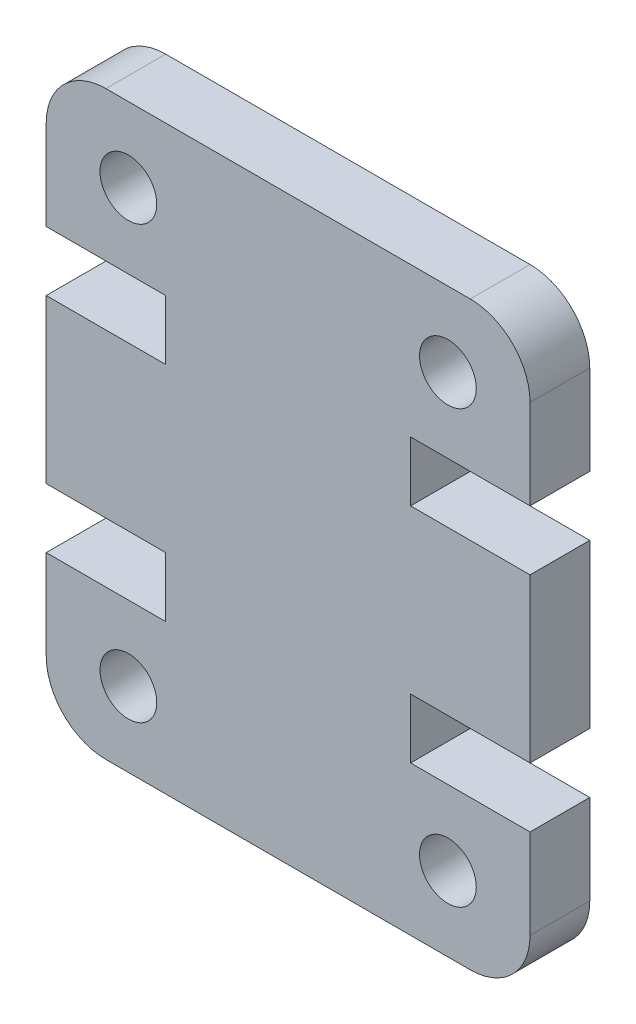
ISO-10303-21;
HEADER;
FILE_DESCRIPTION(('STEP AP214'),'2;1');
FILE_NAME('part.step','',(''),(''),'','','');
FILE_SCHEMA(('AUTOMOTIVE_DESIGN { 1 0 10303 214 1 1 1 1 }'));
ENDSEC;
DATA;
#1=APPLICATION_CONTEXT('core data for automotive mechanical design processes');
#2=APPLICATION_PROTOCOL_DEFINITION('international standard','automotive_design',2000,#1);
#3=PRODUCT_CONTEXT('',#1,'mechanical');
#4=PRODUCT('Part','Part','',(#3));
#5=PRODUCT_RELATED_PRODUCT_CATEGORY('part','',(#4));
#6=PRODUCT_DEFINITION_FORMATION('','',#4);
#7=PRODUCT_DEFINITION_CONTEXT('part definition',#1,'design');
#8=PRODUCT_DEFINITION('design','',#6,#7);
#9=PRODUCT_DEFINITION_SHAPE('','',#8);
#10=(LENGTH_UNIT() NAMED_UNIT(*) SI_UNIT(.MILLI.,.METRE.));
#11=(NAMED_UNIT(*) PLANE_ANGLE_UNIT() SI_UNIT($,.RADIAN.));
#12=(NAMED_UNIT(*) SI_UNIT($,.STERADIAN.) SOLID_ANGLE_UNIT());
#13=UNCERTAINTY_MEASURE_WITH_UNIT(LENGTH_MEASURE(1.E-05),#10,'distance_accuracy_value','');
#14=(GEOMETRIC_REPRESENTATION_CONTEXT(3) GLOBAL_UNCERTAINTY_ASSIGNED_CONTEXT((#13)) GLOBAL_UNIT_ASSIGNED_CONTEXT((#10,
#11,#12)) REPRESENTATION_CONTEXT('',''));
#15=CARTESIAN_POINT('',(0.,0.,0.));
#16=DIRECTION('',(0.,0.,1.));
#17=DIRECTION('',(1.,0.,0.));
#18=AXIS2_PLACEMENT_3D('',#15,#16,#17);
#19=CARTESIAN_POINT('',(14.1999999999999,2.00000000000013,4.));
#20=DIRECTION('',(0.,0.,-1.));
#21=DIRECTION('',(-1.,0.,0.));
#22=AXIS2_PLACEMENT_3D('',#19,#20,#21);
#23=CYLINDRICAL_SURFACE('',#22,2.00000000000013);
#24=CARTESIAN_POINT('',(14.1999999999999,2.00000000000013,2.));
#25=DIRECTION('',(0.,0.,1.));
#26=DIRECTION('',(1.,0.,0.));
#27=AXIS2_PLACEMENT_3D('',#24,#25,#26);
#28=CIRCLE('',#27,2.00000000000013);
#29=CARTESIAN_POINT('',(14.1999999999999,0.,2.));
#30=VERTEX_POINT('',#29);
#31=CARTESIAN_POINT('',(16.2,2.00000000000013,2.));
#32=VERTEX_POINT('',#31);
#33=EDGE_CURVE('E387',#30,#32,#28,.T.);
#34=ORIENTED_EDGE('',*,*,#33,.F.);
#35=DIRECTION('',(0.,0.,-1.));
#36=VECTOR('',#35,1.);
#37=CARTESIAN_POINT('',(14.1999999999999,0.,4.));
#38=LINE('',#37,#36);
#39=CARTESIAN_POINT('',(14.1999999999999,0.,0.));
#40=VERTEX_POINT('',#39);
#41=EDGE_CURVE('E56',#30,#40,#38,.T.);
#42=ORIENTED_EDGE('',*,*,#41,.T.);
#43=CARTESIAN_POINT('',(14.1999999999999,2.00000000000013,0.));
#44=DIRECTION('',(0.,0.,1.));
#45=DIRECTION('',(-1.,0.,0.));
#46=AXIS2_PLACEMENT_3D('',#43,#44,#45);
#47=CIRCLE('',#46,2.00000000000013);
#48=CARTESIAN_POINT('',(16.2,2.00000000000013,0.));
#49=VERTEX_POINT('',#48);
#50=EDGE_CURVE('E265',#40,#49,#47,.T.);
#51=ORIENTED_EDGE('',*,*,#50,.T.);
#52=DIRECTION('',(0.,0.,-1.));
#53=VECTOR('',#52,1.);
#54=CARTESIAN_POINT('',(16.2,2.00000000000013,4.));
#55=LINE('',#54,#53);
#56=EDGE_CURVE('E11',#32,#49,#55,.T.);
#57=ORIENTED_EDGE('',*,*,#56,.F.);
#58=EDGE_LOOP('',(#34,#42,#51,#57));
#59=FACE_BOUND('',#58,.T.);
#60=ADVANCED_FACE('F33',(#59),#23,.T.);
#61=CARTESIAN_POINT('',(16.2,5.00000000000021,4.));
#62=DIRECTION('',(-1.,0.,0.));
#63=DIRECTION('',(0.,0.,1.));
#64=AXIS2_PLACEMENT_3D('',#61,#62,#63);
#65=PLANE('',#64);
#66=DIRECTION('',(0.,1.,0.));
#67=VECTOR('',#66,1.);
#68=CARTESIAN_POINT('',(16.2,0.,2.));
#69=LINE('',#68,#67);
#70=CARTESIAN_POINT('',(16.2,5.00000000000021,2.));
#71=VERTEX_POINT('',#70);
#72=EDGE_CURVE('E435',#32,#71,#69,.T.);
#73=ORIENTED_EDGE('',*,*,#72,.F.);
#74=ORIENTED_EDGE('',*,*,#56,.T.);
#75=DIRECTION('',(0.,1.,0.));
#76=VECTOR('',#75,1.);
#77=CARTESIAN_POINT('',(16.2,5.00000000000021,0.));
#78=LINE('',#77,#76);
#79=CARTESIAN_POINT('',(16.2,5.00000000000021,0.));
#80=VERTEX_POINT('',#79);
#81=EDGE_CURVE('E260',#49,#80,#78,.T.);
#82=ORIENTED_EDGE('',*,*,#81,.T.);
#83=DIRECTION('',(0.,0.,-1.));
#84=VECTOR('',#83,1.);
#85=CARTESIAN_POINT('',(16.2,5.00000000000021,4.));
#86=LINE('',#85,#84);
#87=EDGE_CURVE('E41',#71,#80,#86,.T.);
#88=ORIENTED_EDGE('',*,*,#87,.F.);
#89=EDGE_LOOP('',(#73,#74,#82,#88));
#90=FACE_BOUND('',#89,.T.);
#91=ADVANCED_FACE('F261',(#90),#65,.F.);
#92=CARTESIAN_POINT('',(12.1999999999997,5.00000000000021,4.));
#93=DIRECTION('',(0.,-1.,0.));
#94=DIRECTION('',(0.,0.,-1.));
#95=AXIS2_PLACEMENT_3D('',#92,#93,#94);
#96=PLANE('',#95);
#97=DIRECTION('',(-1.,0.,0.));
#98=VECTOR('',#97,1.);
#99=CARTESIAN_POINT('',(12.1999999999997,5.00000000000021,2.));
#100=LINE('',#99,#98);
#101=CARTESIAN_POINT('',(12.1999999999997,5.00000000000021,2.));
#102=VERTEX_POINT('',#101);
#103=EDGE_CURVE('E256',#71,#102,#100,.T.);
#104=ORIENTED_EDGE('',*,*,#103,.F.);
#105=ORIENTED_EDGE('',*,*,#87,.T.);
#106=DIRECTION('',(-1.,0.,0.));
#107=VECTOR('',#106,1.);
#108=CARTESIAN_POINT('',(12.1999999999997,5.00000000000021,0.));
#109=LINE('',#108,#107);
#110=CARTESIAN_POINT('',(12.1999999999997,5.00000000000021,0.));
#111=VERTEX_POINT('',#110);
#112=EDGE_CURVE('E254',#80,#111,#109,.T.);
#113=ORIENTED_EDGE('',*,*,#112,.T.);
#114=DIRECTION('',(0.,0.,-1.));
#115=VECTOR('',#114,1.);
#116=CARTESIAN_POINT('',(12.1999999999997,5.00000000000021,4.));
#117=LINE('',#116,#115);
#118=EDGE_CURVE('E244',#102,#111,#117,.T.);
#119=ORIENTED_EDGE('',*,*,#118,.F.);
#120=EDGE_LOOP('',(#104,#105,#113,#119));
#121=FACE_BOUND('',#120,.T.);
#122=ADVANCED_FACE('F251',(#121),#96,.F.);
#123=CARTESIAN_POINT('',(12.1999999999997,7.00000000000034,4.));
#124=DIRECTION('',(-1.,0.,0.));
#125=DIRECTION('',(0.,0.,1.));
#126=AXIS2_PLACEMENT_3D('',#123,#124,#125);
#127=PLANE('',#126);
#128=DIRECTION('',(0.,1.,0.));
#129=VECTOR('',#128,1.);
#130=CARTESIAN_POINT('',(12.1999999999997,7.00000000000034,2.));
#131=LINE('',#130,#129);
#132=CARTESIAN_POINT('',(12.1999999999997,7.00000000000034,2.));
#133=VERTEX_POINT('',#132);
#134=EDGE_CURVE('E384',#102,#133,#131,.T.);
#135=ORIENTED_EDGE('',*,*,#134,.F.);
#136=ORIENTED_EDGE('',*,*,#118,.T.);
#137=DIRECTION('',(0.,1.,0.));
#138=VECTOR('',#137,1.);
#139=CARTESIAN_POINT('',(12.1999999999997,7.00000000000034,0.));
#140=LINE('',#139,#138);
#141=CARTESIAN_POINT('',(12.1999999999997,7.00000000000034,0.));
#142=VERTEX_POINT('',#141);
#143=EDGE_CURVE('E271',#111,#142,#140,.T.);
#144=ORIENTED_EDGE('',*,*,#143,.T.);
#145=DIRECTION('',(0.,0.,-1.));
#146=VECTOR('',#145,1.);
#147=CARTESIAN_POINT('',(12.1999999999997,7.00000000000034,4.));
#148=LINE('',#147,#146);
#149=EDGE_CURVE('E242',#133,#142,#148,.T.);
#150=ORIENTED_EDGE('',*,*,#149,.F.);
#151=EDGE_LOOP('',(#135,#136,#144,#150));
#152=FACE_BOUND('',#151,.T.);
#153=ADVANCED_FACE('F483',(#152),#127,.F.);
#154=CARTESIAN_POINT('',(16.2,7.00000000000034,4.));
#155=DIRECTION('',(0.,1.,0.));
#156=DIRECTION('',(-1.,0.,0.));
#157=AXIS2_PLACEMENT_3D('',#154,#155,#156);
#158=PLANE('',#157);
#159=DIRECTION('',(1.,0.,0.));
#160=VECTOR('',#159,1.);
#161=CARTESIAN_POINT('',(16.2,7.00000000000034,2.));
#162=LINE('',#161,#160);
#163=CARTESIAN_POINT('',(16.2,7.00000000000034,2.));
#164=VERTEX_POINT('',#163);
#165=EDGE_CURVE('E382',#133,#164,#162,.T.);
#166=ORIENTED_EDGE('',*,*,#165,.F.);
#167=ORIENTED_EDGE('',*,*,#149,.T.);
#168=DIRECTION('',(1.,0.,0.));
#169=VECTOR('',#168,1.);
#170=CARTESIAN_POINT('',(16.2,7.00000000000034,0.));
#171=LINE('',#170,#169);
#172=CARTESIAN_POINT('',(16.2,7.00000000000034,0.));
#173=VERTEX_POINT('',#172);
#174=EDGE_CURVE('E273',#142,#173,#171,.T.);
#175=ORIENTED_EDGE('',*,*,#174,.T.);
#176=DIRECTION('',(0.,0.,-1.));
#177=VECTOR('',#176,1.);
#178=CARTESIAN_POINT('',(16.2,7.00000000000034,4.));
#179=LINE('',#178,#177);
#180=EDGE_CURVE('E240',#164,#173,#179,.T.);
#181=ORIENTED_EDGE('',*,*,#180,.F.);
#182=EDGE_LOOP('',(#166,#167,#175,#181));
#183=FACE_BOUND('',#182,.T.);
#184=ADVANCED_FACE('F488',(#183),#158,.F.);
#185=CARTESIAN_POINT('',(16.2,7.00000000000034,4.));
#186=DIRECTION('',(-1.,0.,0.));
#187=DIRECTION('',(0.,0.,1.));
#188=AXIS2_PLACEMENT_3D('',#185,#186,#187);
#189=PLANE('',#188);
#190=CARTESIAN_POINT('',(16.2,12.4549999999997,2.));
#191=VERTEX_POINT('',#190);
#192=EDGE_CURVE('E434',#164,#191,#69,.T.);
#193=ORIENTED_EDGE('',*,*,#192,.F.);
#194=ORIENTED_EDGE('',*,*,#180,.T.);
#195=DIRECTION('',(0.,1.,0.));
#196=VECTOR('',#195,1.);
#197=CARTESIAN_POINT('',(16.2,7.00000000000034,0.));
#198=LINE('',#197,#196);
#199=CARTESIAN_POINT('',(16.2,12.4549999999997,0.));
#200=VERTEX_POINT('',#199);
#201=EDGE_CURVE('E279',#173,#200,#198,.T.);
#202=ORIENTED_EDGE('',*,*,#201,.T.);
#203=DIRECTION('',(0.,0.,-1.));
#204=VECTOR('',#203,1.);
#205=CARTESIAN_POINT('',(16.2,12.4549999999997,4.));
#206=LINE('',#205,#204);
#207=EDGE_CURVE('E238',#191,#200,#206,.T.);
#208=ORIENTED_EDGE('',*,*,#207,.F.);
#209=EDGE_LOOP('',(#193,#194,#202,#208));
#210=FACE_BOUND('',#209,.T.);
#211=ADVANCED_FACE('F492',(#210),#189,.F.);
#212=CARTESIAN_POINT('',(16.2,12.4549999999997,4.));
#213=DIRECTION('',(0.,-1.,0.));
#214=DIRECTION('',(1.,0.,0.));
#215=AXIS2_PLACEMENT_3D('',#212,#213,#214);
#216=PLANE('',#215);
#217=DIRECTION('',(-1.,0.,0.));
#218=VECTOR('',#217,1.);
#219=CARTESIAN_POINT('',(16.2,12.4549999999997,2.));
#220=LINE('',#219,#218);
#221=CARTESIAN_POINT('',(12.1999999999997,12.4549999999997,2.));
#222=VERTEX_POINT('',#221);
#223=EDGE_CURVE('E380',#191,#222,#220,.T.);
#224=ORIENTED_EDGE('',*,*,#223,.F.);
#225=ORIENTED_EDGE('',*,*,#207,.T.);
#226=DIRECTION('',(-1.,0.,0.));
#227=VECTOR('',#226,1.);
#228=CARTESIAN_POINT('',(16.2,12.4549999999997,0.));
#229=LINE('',#228,#227);
#230=CARTESIAN_POINT('',(12.1999999999997,12.4549999999997,0.));
#231=VERTEX_POINT('',#230);
#232=EDGE_CURVE('E282',#200,#231,#229,.T.);
#233=ORIENTED_EDGE('',*,*,#232,.T.);
#234=DIRECTION('',(0.,0.,-1.));
#235=VECTOR('',#234,1.);
#236=CARTESIAN_POINT('',(12.1999999999997,12.4549999999997,4.));
#237=LINE('',#236,#235);
#238=EDGE_CURVE('E236',#222,#231,#237,.T.);
#239=ORIENTED_EDGE('',*,*,#238,.F.);
#240=EDGE_LOOP('',(#224,#225,#233,#239));
#241=FACE_BOUND('',#240,.T.);
#242=ADVANCED_FACE('F496',(#241),#216,.F.);
#243=CARTESIAN_POINT('',(12.1999999999997,12.4549999999997,4.));
#244=DIRECTION('',(-1.,0.,0.));
#245=DIRECTION('',(0.,0.,1.));
#246=AXIS2_PLACEMENT_3D('',#243,#244,#245);
#247=PLANE('',#246);
#248=DIRECTION('',(0.,1.,0.));
#249=VECTOR('',#248,1.);
#250=CARTESIAN_POINT('',(12.1999999999997,12.4549999999997,2.));
#251=LINE('',#250,#249);
#252=CARTESIAN_POINT('',(12.1999999999997,14.4549999999998,2.));
#253=VERTEX_POINT('',#252);
#254=EDGE_CURVE('E378',#222,#253,#251,.T.);
#255=ORIENTED_EDGE('',*,*,#254,.F.);
#256=ORIENTED_EDGE('',*,*,#238,.T.);
#257=DIRECTION('',(0.,1.,0.));
#258=VECTOR('',#257,1.);
#259=CARTESIAN_POINT('',(12.1999999999997,12.4549999999997,0.));
#260=LINE('',#259,#258);
#261=CARTESIAN_POINT('',(12.1999999999997,14.4549999999998,0.));
#262=VERTEX_POINT('',#261);
#263=EDGE_CURVE('E285',#231,#262,#260,.T.);
#264=ORIENTED_EDGE('',*,*,#263,.T.);
#265=DIRECTION('',(0.,0.,-1.));
#266=VECTOR('',#265,1.);
#267=CARTESIAN_POINT('',(12.1999999999997,14.4549999999998,4.));
#268=LINE('',#267,#266);
#269=EDGE_CURVE('E234',#253,#262,#268,.T.);
#270=ORIENTED_EDGE('',*,*,#269,.F.);
#271=EDGE_LOOP('',(#255,#256,#264,#270));
#272=FACE_BOUND('',#271,.T.);
#273=ADVANCED_FACE('F500',(#272),#247,.F.);
#274=CARTESIAN_POINT('',(12.1999999999997,14.4549999999998,4.));
#275=DIRECTION('',(0.,1.,0.));
#276=DIRECTION('',(0.,0.,1.));
#277=AXIS2_PLACEMENT_3D('',#274,#275,#276);
#278=PLANE('',#277);
#279=DIRECTION('',(1.,0.,0.));
#280=VECTOR('',#279,1.);
#281=CARTESIAN_POINT('',(12.1999999999997,14.4549999999998,2.));
#282=LINE('',#281,#280);
#283=CARTESIAN_POINT('',(16.2,14.4549999999998,2.));
#284=VERTEX_POINT('',#283);
#285=EDGE_CURVE('E376',#253,#284,#282,.T.);
#286=ORIENTED_EDGE('',*,*,#285,.F.);
#287=ORIENTED_EDGE('',*,*,#269,.T.);
#288=DIRECTION('',(1.,0.,0.));
#289=VECTOR('',#288,1.);
#290=CARTESIAN_POINT('',(12.1999999999997,14.4549999999998,0.));
#291=LINE('',#290,#289);
#292=CARTESIAN_POINT('',(16.2,14.4549999999998,0.));
#293=VERTEX_POINT('',#292);
#294=EDGE_CURVE('E288',#262,#293,#291,.T.);
#295=ORIENTED_EDGE('',*,*,#294,.T.);
#296=DIRECTION('',(0.,0.,-1.));
#297=VECTOR('',#296,1.);
#298=CARTESIAN_POINT('',(16.2,14.4549999999998,4.));
#299=LINE('',#298,#297);
#300=EDGE_CURVE('E232',#284,#293,#299,.T.);
#301=ORIENTED_EDGE('',*,*,#300,.F.);
#302=EDGE_LOOP('',(#286,#287,#295,#301));
#303=FACE_BOUND('',#302,.T.);
#304=ADVANCED_FACE('F504',(#303),#278,.F.);
#305=CARTESIAN_POINT('',(16.2,14.4549999999998,4.));
#306=DIRECTION('',(-1.,0.,0.));
#307=DIRECTION('',(0.,0.,1.));
#308=AXIS2_PLACEMENT_3D('',#305,#306,#307);
#309=PLANE('',#308);
#310=CARTESIAN_POINT('',(16.2,17.4549999999999,2.));
#311=VERTEX_POINT('',#310);
#312=EDGE_CURVE('E432',#284,#311,#69,.T.);
#313=ORIENTED_EDGE('',*,*,#312,.F.);
#314=ORIENTED_EDGE('',*,*,#300,.T.);
#315=DIRECTION('',(0.,1.,0.));
#316=VECTOR('',#315,1.);
#317=CARTESIAN_POINT('',(16.2,14.4549999999998,0.));
#318=LINE('',#317,#316);
#319=CARTESIAN_POINT('',(16.2,17.4549999999999,0.));
#320=VERTEX_POINT('',#319);
#321=EDGE_CURVE('E291',#293,#320,#318,.T.);
#322=ORIENTED_EDGE('',*,*,#321,.T.);
#323=DIRECTION('',(0.,0.,-1.));
#324=VECTOR('',#323,1.);
#325=CARTESIAN_POINT('',(16.2,17.4549999999999,4.));
#326=LINE('',#325,#324);
#327=EDGE_CURVE('E230',#311,#320,#326,.T.);
#328=ORIENTED_EDGE('',*,*,#327,.F.);
#329=EDGE_LOOP('',(#313,#314,#322,#328));
#330=FACE_BOUND('',#329,.T.);
#331=ADVANCED_FACE('F508',(#330),#309,.F.);
#332=CARTESIAN_POINT('',(14.1999999999999,17.4549999999999,4.));
#333=DIRECTION('',(0.,0.,-1.));
#334=DIRECTION('',(-1.,0.,0.));
#335=AXIS2_PLACEMENT_3D('',#332,#333,#334);
#336=CYLINDRICAL_SURFACE('',#335,2.00000000000013);
#337=CARTESIAN_POINT('',(14.1999999999999,17.4549999999999,2.));
#338=DIRECTION('',(0.,0.,1.));
#339=DIRECTION('',(1.,0.,0.));
#340=AXIS2_PLACEMENT_3D('',#337,#338,#339);
#341=CIRCLE('',#340,2.00000000000013);
#342=CARTESIAN_POINT('',(14.1999999999999,19.455,2.));
#343=VERTEX_POINT('',#342);
#344=EDGE_CURVE('E203',#311,#343,#341,.T.);
#345=ORIENTED_EDGE('',*,*,#344,.F.);
#346=ORIENTED_EDGE('',*,*,#327,.T.);
#347=CARTESIAN_POINT('',(14.1999999999999,17.4549999999999,0.));
#348=DIRECTION('',(0.,0.,1.));
#349=DIRECTION('',(1.,0.,0.));
#350=AXIS2_PLACEMENT_3D('',#347,#348,#349);
#351=CIRCLE('',#350,2.00000000000013);
#352=CARTESIAN_POINT('',(14.1999999999999,19.455,0.));
#353=VERTEX_POINT('',#352);
#354=EDGE_CURVE('E294',#320,#353,#351,.T.);
#355=ORIENTED_EDGE('',*,*,#354,.T.);
#356=DIRECTION('',(0.,0.,-1.));
#357=VECTOR('',#356,1.);
#358=CARTESIAN_POINT('',(14.1999999999999,19.455,4.));
#359=LINE('',#358,#357);
#360=EDGE_CURVE('E223',#343,#353,#359,.T.);
#361=ORIENTED_EDGE('',*,*,#360,.F.);
#362=EDGE_LOOP('',(#345,#346,#355,#361));
#363=FACE_BOUND('',#362,.T.);
#364=ADVANCED_FACE('F512',(#363),#336,.T.);
#365=CARTESIAN_POINT('',(2.00000000000012,19.455,4.));
#366=DIRECTION('',(0.,-1.,0.));
#367=DIRECTION('',(0.,0.,-1.));
#368=AXIS2_PLACEMENT_3D('',#365,#366,#367);
#369=PLANE('',#368);
#370=DIRECTION('',(-1.,0.,0.));
#371=VECTOR('',#370,1.);
#372=CARTESIAN_POINT('',(16.2,19.455,2.));
#373=LINE('',#372,#371);
#374=CARTESIAN_POINT('',(2.00000000000012,19.455,2.));
#375=VERTEX_POINT('',#374);
#376=EDGE_CURVE('E199',#343,#375,#373,.T.);
#377=ORIENTED_EDGE('',*,*,#376,.F.);
#378=ORIENTED_EDGE('',*,*,#360,.T.);
#379=DIRECTION('',(-1.,0.,0.));
#380=VECTOR('',#379,1.);
#381=CARTESIAN_POINT('',(2.00000000000012,19.455,0.));
#382=LINE('',#381,#380);
#383=CARTESIAN_POINT('',(2.00000000000012,19.455,0.));
#384=VERTEX_POINT('',#383);
#385=EDGE_CURVE('E297',#353,#384,#382,.T.);
#386=ORIENTED_EDGE('',*,*,#385,.T.);
#387=DIRECTION('',(0.,0.,-1.));
#388=VECTOR('',#387,1.);
#389=CARTESIAN_POINT('',(2.00000000000012,19.455,4.));
#390=LINE('',#389,#388);
#391=EDGE_CURVE('E221',#375,#384,#390,.T.);
#392=ORIENTED_EDGE('',*,*,#391,.F.);
#393=EDGE_LOOP('',(#377,#378,#386,#392));
#394=FACE_BOUND('',#393,.T.);
#395=ADVANCED_FACE('F516',(#394),#369,.F.);
#396=CARTESIAN_POINT('',(2.00000000000012,17.4549999999999,4.));
#397=DIRECTION('',(0.,0.,-1.));
#398=DIRECTION('',(-1.,0.,0.));
#399=AXIS2_PLACEMENT_3D('',#396,#397,#398);
#400=CYLINDRICAL_SURFACE('',#399,2.00000000000013);
#401=CARTESIAN_POINT('',(2.00000000000012,17.4549999999999,2.));
#402=DIRECTION('',(0.,0.,1.));
#403=DIRECTION('',(1.,0.,0.));
#404=AXIS2_PLACEMENT_3D('',#401,#402,#403);
#405=CIRCLE('',#404,2.00000000000013);
#406=CARTESIAN_POINT('',(0.,17.4549999999999,2.));
#407=VERTEX_POINT('',#406);
#408=EDGE_CURVE('E193',#375,#407,#405,.T.);
#409=ORIENTED_EDGE('',*,*,#408,.F.);
#410=ORIENTED_EDGE('',*,*,#391,.T.);
#411=CARTESIAN_POINT('',(2.00000000000012,17.4549999999999,0.));
#412=DIRECTION('',(0.,0.,1.));
#413=DIRECTION('',(-1.,0.,0.));
#414=AXIS2_PLACEMENT_3D('',#411,#412,#413);
#415=CIRCLE('',#414,2.00000000000013);
#416=CARTESIAN_POINT('',(0.,17.4549999999999,0.));
#417=VERTEX_POINT('',#416);
#418=EDGE_CURVE('E219',#384,#417,#415,.T.);
#419=ORIENTED_EDGE('',*,*,#418,.T.);
#420=DIRECTION('',(0.,0.,-1.));
#421=VECTOR('',#420,1.);
#422=CARTESIAN_POINT('',(0.,17.4549999999999,4.));
#423=LINE('',#422,#421);
#424=EDGE_CURVE('E210',#407,#417,#423,.T.);
#425=ORIENTED_EDGE('',*,*,#424,.F.);
#426=EDGE_LOOP('',(#409,#410,#419,#425));
#427=FACE_BOUND('',#426,.T.);
#428=ADVANCED_FACE('F217',(#427),#400,.T.);
#429=CARTESIAN_POINT('',(0.,14.4549999999998,4.));
#430=DIRECTION('',(1.,0.,0.));
#431=DIRECTION('',(0.,1.,0.));
#432=AXIS2_PLACEMENT_3D('',#429,#430,#431);
#433=PLANE('',#432);
#434=DIRECTION('',(0.,-1.,0.));
#435=VECTOR('',#434,1.);
#436=CARTESIAN_POINT('',(0.,19.455,2.));
#437=LINE('',#436,#435);
#438=CARTESIAN_POINT('',(0.,14.4549999999998,2.));
#439=VERTEX_POINT('',#438);
#440=EDGE_CURVE('E196',#407,#439,#437,.T.);
#441=ORIENTED_EDGE('',*,*,#440,.F.);
#442=ORIENTED_EDGE('',*,*,#424,.T.);
#443=DIRECTION('',(0.,-1.,0.));
#444=VECTOR('',#443,1.);
#445=CARTESIAN_POINT('',(0.,14.4549999999998,0.));
#446=LINE('',#445,#444);
#447=CARTESIAN_POINT('',(0.,14.4549999999998,0.));
#448=VERTEX_POINT('',#447);
#449=EDGE_CURVE('E301',#417,#448,#446,.T.);
#450=ORIENTED_EDGE('',*,*,#449,.T.);
#451=DIRECTION('',(0.,0.,-1.));
#452=VECTOR('',#451,1.);
#453=CARTESIAN_POINT('',(0.,14.4549999999998,4.));
#454=LINE('',#453,#452);
#455=EDGE_CURVE('E212',#439,#448,#454,.T.);
#456=ORIENTED_EDGE('',*,*,#455,.F.);
#457=EDGE_LOOP('',(#441,#442,#450,#456));
#458=FACE_BOUND('',#457,.T.);
#459=ADVANCED_FACE('F208',(#458),#433,.F.);
#460=CARTESIAN_POINT('',(4.00000000000025,14.4549999999998,4.));
#461=DIRECTION('',(0.,1.,0.));
#462=DIRECTION('',(0.,0.,1.));
#463=AXIS2_PLACEMENT_3D('',#460,#461,#462);
#464=PLANE('',#463);
#465=DIRECTION('',(1.,0.,0.));
#466=VECTOR('',#465,1.);
#467=CARTESIAN_POINT('',(4.00000000000025,14.4549999999998,2.));
#468=LINE('',#467,#466);
#469=CARTESIAN_POINT('',(4.00000000000025,14.4549999999998,2.));
#470=VERTEX_POINT('',#469);
#471=EDGE_CURVE('E204',#439,#470,#468,.T.);
#472=ORIENTED_EDGE('',*,*,#471,.F.);
#473=ORIENTED_EDGE('',*,*,#455,.T.);
#474=DIRECTION('',(1.,0.,0.));
#475=VECTOR('',#474,1.);
#476=CARTESIAN_POINT('',(4.00000000000025,14.4549999999998,0.));
#477=LINE('',#476,#475);
#478=CARTESIAN_POINT('',(4.00000000000025,14.4549999999998,0.));
#479=VERTEX_POINT('',#478);
#480=EDGE_CURVE('E303',#448,#479,#477,.T.);
#481=ORIENTED_EDGE('',*,*,#480,.T.);
#482=DIRECTION('',(0.,0.,-1.));
#483=VECTOR('',#482,1.);
#484=CARTESIAN_POINT('',(4.00000000000025,14.4549999999998,4.));
#485=LINE('',#484,#483);
#486=EDGE_CURVE('E225',#470,#479,#485,.T.);
#487=ORIENTED_EDGE('',*,*,#486,.F.);
#488=EDGE_LOOP('',(#472,#473,#481,#487));
#489=FACE_BOUND('',#488,.T.);
#490=ADVANCED_FACE('F358',(#489),#464,.F.);
#491=CARTESIAN_POINT('',(4.00000000000025,12.4549999999997,4.));
#492=DIRECTION('',(1.,0.,0.));
#493=DIRECTION('',(0.,0.,-1.));
#494=AXIS2_PLACEMENT_3D('',#491,#492,#493);
#495=PLANE('',#494);
#496=DIRECTION('',(0.,-1.,0.));
#497=VECTOR('',#496,1.);
#498=CARTESIAN_POINT('',(4.00000000000025,12.4549999999997,2.));
#499=LINE('',#498,#497);
#500=CARTESIAN_POINT('',(4.00000000000025,12.4549999999997,2.));
#501=VERTEX_POINT('',#500);
#502=EDGE_CURVE('E355',#470,#501,#499,.T.);
#503=ORIENTED_EDGE('',*,*,#502,.F.);
#504=ORIENTED_EDGE('',*,*,#486,.T.);
#505=DIRECTION('',(0.,-1.,0.));
#506=VECTOR('',#505,1.);
#507=CARTESIAN_POINT('',(4.00000000000025,12.4549999999997,0.));
#508=LINE('',#507,#506);
#509=CARTESIAN_POINT('',(4.00000000000025,12.4549999999997,0.));
#510=VERTEX_POINT('',#509);
#511=EDGE_CURVE('E306',#479,#510,#508,.T.);
#512=ORIENTED_EDGE('',*,*,#511,.T.);
#513=DIRECTION('',(0.,0.,-1.));
#514=VECTOR('',#513,1.);
#515=CARTESIAN_POINT('',(4.00000000000025,12.4549999999997,4.));
#516=LINE('',#515,#514);
#517=EDGE_CURVE('E347',#501,#510,#516,.T.);
#518=ORIENTED_EDGE('',*,*,#517,.F.);
#519=EDGE_LOOP('',(#503,#504,#512,#518));
#520=FACE_BOUND('',#519,.T.);
#521=ADVANCED_FACE('F351',(#520),#495,.F.);
#522=CARTESIAN_POINT('',(0.,12.4549999999997,4.));
#523=DIRECTION('',(0.,-1.,0.));
#524=DIRECTION('',(1.,0.,0.));
#525=AXIS2_PLACEMENT_3D('',#522,#523,#524);
#526=PLANE('',#525);
#527=DIRECTION('',(-1.,0.,0.));
#528=VECTOR('',#527,1.);
#529=CARTESIAN_POINT('',(0.,12.4549999999997,2.));
#530=LINE('',#529,#528);
#531=CARTESIAN_POINT('',(0.,12.4549999999997,2.));
#532=VERTEX_POINT('',#531);
#533=EDGE_CURVE('E365',#501,#532,#530,.T.);
#534=ORIENTED_EDGE('',*,*,#533,.F.);
#535=ORIENTED_EDGE('',*,*,#517,.T.);
#536=DIRECTION('',(-1.,0.,0.));
#537=VECTOR('',#536,1.);
#538=CARTESIAN_POINT('',(0.,12.4549999999997,0.));
#539=LINE('',#538,#537);
#540=CARTESIAN_POINT('',(0.,12.4549999999997,0.));
#541=VERTEX_POINT('',#540);
#542=EDGE_CURVE('E309',#510,#541,#539,.T.);
#543=ORIENTED_EDGE('',*,*,#542,.T.);
#544=DIRECTION('',(0.,0.,-1.));
#545=VECTOR('',#544,1.);
#546=CARTESIAN_POINT('',(0.,12.4549999999997,4.));
#547=LINE('',#546,#545);
#548=EDGE_CURVE('E345',#532,#541,#547,.T.);
#549=ORIENTED_EDGE('',*,*,#548,.F.);
#550=EDGE_LOOP('',(#534,#535,#543,#549));
#551=FACE_BOUND('',#550,.T.);
#552=ADVANCED_FACE('F364',(#551),#526,.F.);
#553=CARTESIAN_POINT('',(0.,7.00000000000034,4.));
#554=DIRECTION('',(1.,0.,0.));
#555=DIRECTION('',(0.,1.,0.));
#556=AXIS2_PLACEMENT_3D('',#553,#554,#555);
#557=PLANE('',#556);
#558=CARTESIAN_POINT('',(0.,7.00000000000032,2.));
#559=VERTEX_POINT('',#558);
#560=EDGE_CURVE('E214',#532,#559,#437,.T.);
#561=ORIENTED_EDGE('',*,*,#560,.F.);
#562=ORIENTED_EDGE('',*,*,#548,.T.);
#563=DIRECTION('',(0.,-1.,0.));
#564=VECTOR('',#563,1.);
#565=CARTESIAN_POINT('',(0.,7.00000000000034,0.));
#566=LINE('',#565,#564);
#567=CARTESIAN_POINT('',(0.,7.00000000000034,0.));
#568=VERTEX_POINT('',#567);
#569=EDGE_CURVE('E312',#541,#568,#566,.T.);
#570=ORIENTED_EDGE('',*,*,#569,.T.);
#571=DIRECTION('',(0.,0.,-1.));
#572=VECTOR('',#571,1.);
#573=CARTESIAN_POINT('',(0.,7.00000000000034,4.));
#574=LINE('',#573,#572);
#575=EDGE_CURVE('E343',#559,#568,#574,.T.);
#576=ORIENTED_EDGE('',*,*,#575,.F.);
#577=EDGE_LOOP('',(#561,#562,#570,#576));
#578=FACE_BOUND('',#577,.T.);
#579=ADVANCED_FACE('F429',(#578),#557,.F.);
#580=CARTESIAN_POINT('',(0.,7.00000000000034,4.));
#581=DIRECTION('',(0.,1.,0.));
#582=DIRECTION('',(-1.,0.,0.));
#583=AXIS2_PLACEMENT_3D('',#580,#581,#582);
#584=PLANE('',#583);
#585=DIRECTION('',(1.,0.,0.));
#586=VECTOR('',#585,1.);
#587=CARTESIAN_POINT('',(0.,7.00000000000034,2.));
#588=LINE('',#587,#586);
#589=CARTESIAN_POINT('',(4.00000000000016,7.00000000000031,2.));
#590=VERTEX_POINT('',#589);
#591=EDGE_CURVE('E367',#559,#590,#588,.T.);
#592=ORIENTED_EDGE('',*,*,#591,.F.);
#593=ORIENTED_EDGE('',*,*,#575,.T.);
#594=DIRECTION('',(1.,0.,0.));
#595=VECTOR('',#594,1.);
#596=CARTESIAN_POINT('',(0.,7.00000000000034,0.));
#597=LINE('',#596,#595);
#598=CARTESIAN_POINT('',(4.00000000000016,7.00000000000031,0.));
#599=VERTEX_POINT('',#598);
#600=EDGE_CURVE('E315',#568,#599,#597,.T.);
#601=ORIENTED_EDGE('',*,*,#600,.T.);
#602=DIRECTION('',(0.,0.,-1.));
#603=VECTOR('',#602,1.);
#604=CARTESIAN_POINT('',(4.00000000000016,7.00000000000031,4.));
#605=LINE('',#604,#603);
#606=EDGE_CURVE('E341',#590,#599,#605,.T.);
#607=ORIENTED_EDGE('',*,*,#606,.F.);
#608=EDGE_LOOP('',(#592,#593,#601,#607));
#609=FACE_BOUND('',#608,.T.);
#610=ADVANCED_FACE('F426',(#609),#584,.F.);
#611=CARTESIAN_POINT('',(4.00000000000016,7.00000000000031,4.));
#612=DIRECTION('',(1.,0.,0.));
#613=DIRECTION('',(0.,0.,-1.));
#614=AXIS2_PLACEMENT_3D('',#611,#612,#613);
#615=PLANE('',#614);
#616=DIRECTION('',(0.,-1.,0.));
#617=VECTOR('',#616,1.);
#618=CARTESIAN_POINT('',(4.00000000000016,7.00000000000031,2.));
#619=LINE('',#618,#617);
#620=CARTESIAN_POINT('',(4.00000000000016,5.00000000000021,2.));
#621=VERTEX_POINT('',#620);
#622=EDGE_CURVE('E370',#590,#621,#619,.T.);
#623=ORIENTED_EDGE('',*,*,#622,.F.);
#624=ORIENTED_EDGE('',*,*,#606,.T.);
#625=DIRECTION('',(0.,-1.,0.));
#626=VECTOR('',#625,1.);
#627=CARTESIAN_POINT('',(4.00000000000016,7.00000000000031,0.));
#628=LINE('',#627,#626);
#629=CARTESIAN_POINT('',(4.00000000000016,5.00000000000021,0.));
#630=VERTEX_POINT('',#629);
#631=EDGE_CURVE('E318',#599,#630,#628,.T.);
#632=ORIENTED_EDGE('',*,*,#631,.T.);
#633=DIRECTION('',(0.,0.,-1.));
#634=VECTOR('',#633,1.);
#635=CARTESIAN_POINT('',(4.00000000000016,5.00000000000021,4.));
#636=LINE('',#635,#634);
#637=EDGE_CURVE('E339',#621,#630,#636,.T.);
#638=ORIENTED_EDGE('',*,*,#637,.F.);
#639=EDGE_LOOP('',(#623,#624,#632,#638));
#640=FACE_BOUND('',#639,.T.);
#641=ADVANCED_FACE('F422',(#640),#615,.F.);
#642=CARTESIAN_POINT('',(4.00000000000016,5.00000000000021,4.));
#643=DIRECTION('',(0.,-1.,0.));
#644=DIRECTION('',(1.,0.,0.));
#645=AXIS2_PLACEMENT_3D('',#642,#643,#644);
#646=PLANE('',#645);
#647=DIRECTION('',(-1.,0.,0.));
#648=VECTOR('',#647,1.);
#649=CARTESIAN_POINT('',(4.00000000000016,5.00000000000021,2.));
#650=LINE('',#649,#648);
#651=CARTESIAN_POINT('',(0.,5.00000000000021,2.));
#652=VERTEX_POINT('',#651);
#653=EDGE_CURVE('E419',#621,#652,#650,.T.);
#654=ORIENTED_EDGE('',*,*,#653,.F.);
#655=ORIENTED_EDGE('',*,*,#637,.T.);
#656=DIRECTION('',(-1.,0.,0.));
#657=VECTOR('',#656,1.);
#658=CARTESIAN_POINT('',(4.00000000000016,5.00000000000021,0.));
#659=LINE('',#658,#657);
#660=CARTESIAN_POINT('',(0.,5.00000000000021,0.));
#661=VERTEX_POINT('',#660);
#662=EDGE_CURVE('E321',#630,#661,#659,.T.);
#663=ORIENTED_EDGE('',*,*,#662,.T.);
#664=DIRECTION('',(0.,0.,-1.));
#665=VECTOR('',#664,1.);
#666=CARTESIAN_POINT('',(0.,5.00000000000021,4.));
#667=LINE('',#666,#665);
#668=EDGE_CURVE('E337',#652,#661,#667,.T.);
#669=ORIENTED_EDGE('',*,*,#668,.F.);
#670=EDGE_LOOP('',(#654,#655,#663,#669));
#671=FACE_BOUND('',#670,.T.);
#672=ADVANCED_FACE('F417',(#671),#646,.F.);
#673=CARTESIAN_POINT('',(0.,5.00000000000021,4.));
#674=DIRECTION('',(1.,0.,0.));
#675=DIRECTION('',(0.,1.,0.));
#676=AXIS2_PLACEMENT_3D('',#673,#674,#675);
#677=PLANE('',#676);
#678=CARTESIAN_POINT('',(0.,2.00000000000013,2.));
#679=VERTEX_POINT('',#678);
#680=EDGE_CURVE('E216',#652,#679,#437,.T.);
#681=ORIENTED_EDGE('',*,*,#680,.F.);
#682=ORIENTED_EDGE('',*,*,#668,.T.);
#683=DIRECTION('',(0.,-1.,0.));
#684=VECTOR('',#683,1.);
#685=CARTESIAN_POINT('',(0.,5.00000000000021,0.));
#686=LINE('',#685,#684);
#687=CARTESIAN_POINT('',(0.,2.0000000000001,0.));
#688=VERTEX_POINT('',#687);
#689=EDGE_CURVE('E324',#661,#688,#686,.T.);
#690=ORIENTED_EDGE('',*,*,#689,.T.);
#691=DIRECTION('',(0.,0.,-1.));
#692=VECTOR('',#691,1.);
#693=CARTESIAN_POINT('',(0.,2.0000000000001,4.));
#694=LINE('',#693,#692);
#695=EDGE_CURVE('E335',#679,#688,#694,.T.);
#696=ORIENTED_EDGE('',*,*,#695,.F.);
#697=EDGE_LOOP('',(#681,#682,#690,#696));
#698=FACE_BOUND('',#697,.T.);
#699=ADVANCED_FACE('F411',(#698),#677,.F.);
#700=CARTESIAN_POINT('',(2.00000000000007,2.00000000000013,4.));
#701=DIRECTION('',(0.,0.,-1.));
#702=DIRECTION('',(-1.,0.,0.));
#703=AXIS2_PLACEMENT_3D('',#700,#701,#702);
#704=CYLINDRICAL_SURFACE('',#703,2.0000000000001);
#705=CARTESIAN_POINT('',(2.00000000000007,2.00000000000013,2.));
#706=DIRECTION('',(0.,0.,1.));
#707=DIRECTION('',(1.,0.,0.));
#708=AXIS2_PLACEMENT_3D('',#705,#706,#707);
#709=CIRCLE('',#708,2.0000000000001);
#710=CARTESIAN_POINT('',(2.00000000000008,0.,2.));
#711=VERTEX_POINT('',#710);
#712=EDGE_CURVE('E48',#679,#711,#709,.T.);
#713=ORIENTED_EDGE('',*,*,#712,.F.);
#714=ORIENTED_EDGE('',*,*,#695,.T.);
#715=CARTESIAN_POINT('',(2.00000000000007,2.00000000000013,0.));
#716=DIRECTION('',(0.,0.,1.));
#717=DIRECTION('',(1.,0.,0.));
#718=AXIS2_PLACEMENT_3D('',#715,#716,#717);
#719=CIRCLE('',#718,2.0000000000001);
#720=CARTESIAN_POINT('',(2.00000000000008,0.,0.));
#721=VERTEX_POINT('',#720);
#722=EDGE_CURVE('E327',#688,#721,#719,.T.);
#723=ORIENTED_EDGE('',*,*,#722,.T.);
#724=DIRECTION('',(0.,0.,-1.));
#725=VECTOR('',#724,1.);
#726=CARTESIAN_POINT('',(2.00000000000008,0.,4.));
#727=LINE('',#726,#725);
#728=EDGE_CURVE('E333',#711,#721,#727,.T.);
#729=ORIENTED_EDGE('',*,*,#728,.F.);
#730=EDGE_LOOP('',(#713,#714,#723,#729));
#731=FACE_BOUND('',#730,.T.);
#732=ADVANCED_FACE('F407',(#731),#704,.T.);
#733=CARTESIAN_POINT('',(2.00000000000008,0.,4.));
#734=DIRECTION('',(0.,1.,0.));
#735=DIRECTION('',(-1.,0.,0.));
#736=AXIS2_PLACEMENT_3D('',#733,#734,#735);
#737=PLANE('',#736);
#738=DIRECTION('',(1.,0.,0.));
#739=VECTOR('',#738,1.);
#740=CARTESIAN_POINT('',(0.,0.,2.));
#741=LINE('',#740,#739);
#742=EDGE_CURVE('E213',#711,#30,#741,.T.);
#743=ORIENTED_EDGE('',*,*,#742,.F.);
#744=ORIENTED_EDGE('',*,*,#728,.T.);
#745=DIRECTION('',(1.,0.,0.));
#746=VECTOR('',#745,1.);
#747=CARTESIAN_POINT('',(2.00000000000008,0.,0.));
#748=LINE('',#747,#746);
#749=EDGE_CURVE('E330',#721,#40,#748,.T.);
#750=ORIENTED_EDGE('',*,*,#749,.T.);
#751=ORIENTED_EDGE('',*,*,#41,.F.);
#752=EDGE_LOOP('',(#743,#744,#750,#751));
#753=FACE_BOUND('',#752,.T.);
#754=ADVANCED_FACE('F404',(#753),#737,.F.);
#755=CARTESIAN_POINT('',(13.4499999999955,2.50000000000005,4.));
#756=DIRECTION('',(0.,0.,-1.));
#757=DIRECTION('',(-1.,0.,0.));
#758=AXIS2_PLACEMENT_3D('',#755,#756,#757);
#759=CYLINDRICAL_SURFACE('',#758,0.949999999999999);
#760=CARTESIAN_POINT('',(13.4499999999955,2.50000000000005,0.));
#761=DIRECTION('',(0.,0.,1.));
#762=DIRECTION('',(-1.,0.,0.));
#763=AXIS2_PLACEMENT_3D('',#760,#761,#762);
#764=CIRCLE('',#763,0.949999999999999);
#765=CARTESIAN_POINT('',(12.4999999999955,2.50000000000005,0.));
#766=VERTEX_POINT('',#765);
#767=EDGE_CURVE('E398',#766,#766,#764,.T.);
#768=ORIENTED_EDGE('',*,*,#767,.F.);
#769=EDGE_LOOP('',(#768));
#770=FACE_BOUND('',#769,.T.);
#771=CARTESIAN_POINT('',(13.4499999999955,2.50000000000005,2.));
#772=DIRECTION('',(0.,0.,1.));
#773=DIRECTION('',(1.,0.,0.));
#774=AXIS2_PLACEMENT_3D('',#771,#772,#773);
#775=CIRCLE('',#774,0.949999999999999);
#776=CARTESIAN_POINT('',(14.3999999999955,2.50000000000005,2.));
#777=VERTEX_POINT('',#776);
#778=EDGE_CURVE('E443',#777,#777,#775,.T.);
#779=ORIENTED_EDGE('',*,*,#778,.T.);
#780=EDGE_LOOP('',(#779));
#781=FACE_BOUND('',#780,.T.);
#782=ADVANCED_FACE('F449',(#770,#781),#759,.F.);
#783=CARTESIAN_POINT('',(2.7500000000045,2.50000000000004,4.));
#784=DIRECTION('',(0.,0.,-1.));
#785=DIRECTION('',(-1.,0.,0.));
#786=AXIS2_PLACEMENT_3D('',#783,#784,#785);
#787=CYLINDRICAL_SURFACE('',#786,0.95);
#788=CARTESIAN_POINT('',(2.7500000000045,2.50000000000004,0.));
#789=DIRECTION('',(0.,0.,1.));
#790=DIRECTION('',(1.,0.,0.));
#791=AXIS2_PLACEMENT_3D('',#788,#789,#790);
#792=CIRCLE('',#791,0.95);
#793=CARTESIAN_POINT('',(3.7000000000045,2.50000000000004,0.));
#794=VERTEX_POINT('',#793);
#795=EDGE_CURVE('E395',#794,#794,#792,.T.);
#796=ORIENTED_EDGE('',*,*,#795,.F.);
#797=EDGE_LOOP('',(#796));
#798=FACE_BOUND('',#797,.T.);
#799=CARTESIAN_POINT('',(2.7500000000045,2.50000000000004,2.));
#800=DIRECTION('',(0.,0.,1.));
#801=DIRECTION('',(1.,0.,0.));
#802=AXIS2_PLACEMENT_3D('',#799,#800,#801);
#803=CIRCLE('',#802,0.95);
#804=CARTESIAN_POINT('',(3.7000000000045,2.50000000000004,2.));
#805=VERTEX_POINT('',#804);
#806=EDGE_CURVE('E440',#805,#805,#803,.T.);
#807=ORIENTED_EDGE('',*,*,#806,.T.);
#808=EDGE_LOOP('',(#807));
#809=FACE_BOUND('',#808,.T.);
#810=ADVANCED_FACE('F472',(#798,#809),#787,.F.);
#811=CARTESIAN_POINT('',(2.75000000000449,16.9549999999999,4.));
#812=DIRECTION('',(0.,0.,-1.));
#813=DIRECTION('',(-1.,0.,0.));
#814=AXIS2_PLACEMENT_3D('',#811,#812,#813);
#815=CYLINDRICAL_SURFACE('',#814,0.95);
#816=CARTESIAN_POINT('',(2.75000000000449,16.9549999999999,0.));
#817=DIRECTION('',(0.,0.,1.));
#818=DIRECTION('',(-1.,0.,0.));
#819=AXIS2_PLACEMENT_3D('',#816,#817,#818);
#820=CIRCLE('',#819,0.95);
#821=CARTESIAN_POINT('',(1.80000000000449,16.9549999999999,0.));
#822=VERTEX_POINT('',#821);
#823=EDGE_CURVE('E392',#822,#822,#820,.T.);
#824=ORIENTED_EDGE('',*,*,#823,.F.);
#825=EDGE_LOOP('',(#824));
#826=FACE_BOUND('',#825,.T.);
#827=CARTESIAN_POINT('',(2.75000000000449,16.9549999999999,2.));
#828=DIRECTION('',(0.,0.,1.));
#829=DIRECTION('',(1.,0.,0.));
#830=AXIS2_PLACEMENT_3D('',#827,#828,#829);
#831=CIRCLE('',#830,0.95);
#832=CARTESIAN_POINT('',(3.70000000000449,16.9549999999999,2.));
#833=VERTEX_POINT('',#832);
#834=EDGE_CURVE('E437',#833,#833,#831,.T.);
#835=ORIENTED_EDGE('',*,*,#834,.T.);
#836=EDGE_LOOP('',(#835));
#837=FACE_BOUND('',#836,.T.);
#838=ADVANCED_FACE('F463',(#826,#837),#815,.F.);
#839=CARTESIAN_POINT('',(13.4499999999955,16.9549999999999,4.));
#840=DIRECTION('',(0.,0.,-1.));
#841=DIRECTION('',(-1.,0.,0.));
#842=AXIS2_PLACEMENT_3D('',#839,#840,#841);
#843=CYLINDRICAL_SURFACE('',#842,0.949999999999999);
#844=CARTESIAN_POINT('',(13.4499999999955,16.9549999999999,0.));
#845=DIRECTION('',(0.,0.,1.));
#846=DIRECTION('',(1.,0.,0.));
#847=AXIS2_PLACEMENT_3D('',#844,#845,#846);
#848=CIRCLE('',#847,0.949999999999999);
#849=CARTESIAN_POINT('',(14.3999999999955,16.9549999999999,0.));
#850=VERTEX_POINT('',#849);
#851=EDGE_CURVE('E389',#850,#850,#848,.T.);
#852=ORIENTED_EDGE('',*,*,#851,.F.);
#853=EDGE_LOOP('',(#852));
#854=FACE_BOUND('',#853,.T.);
#855=CARTESIAN_POINT('',(13.4499999999955,16.9549999999999,2.));
#856=DIRECTION('',(0.,0.,1.));
#857=DIRECTION('',(1.,0.,0.));
#858=AXIS2_PLACEMENT_3D('',#855,#856,#857);
#859=CIRCLE('',#858,0.949999999999999);
#860=CARTESIAN_POINT('',(14.3999999999955,16.9549999999999,2.));
#861=VERTEX_POINT('',#860);
#862=EDGE_CURVE('E36',#861,#861,#859,.T.);
#863=ORIENTED_EDGE('',*,*,#862,.T.);
#864=EDGE_LOOP('',(#863));
#865=FACE_BOUND('',#864,.T.);
#866=ADVANCED_FACE('F461',(#854,#865),#843,.F.);
#867=CARTESIAN_POINT('',(14.1999999999999,2.00000000000013,0.));
#868=DIRECTION('',(0.,0.,-1.));
#869=DIRECTION('',(-1.,0.,0.));
#870=AXIS2_PLACEMENT_3D('',#867,#868,#869);
#871=PLANE('',#870);
#872=ORIENTED_EDGE('',*,*,#823,.T.);
#873=EDGE_LOOP('',(#872));
#874=FACE_BOUND('',#873,.T.);
#875=ORIENTED_EDGE('',*,*,#767,.T.);
#876=EDGE_LOOP('',(#875));
#877=FACE_BOUND('',#876,.T.);
#878=ORIENTED_EDGE('',*,*,#50,.F.);
#879=ORIENTED_EDGE('',*,*,#749,.F.);
#880=ORIENTED_EDGE('',*,*,#722,.F.);
#881=ORIENTED_EDGE('',*,*,#689,.F.);
#882=ORIENTED_EDGE('',*,*,#662,.F.);
#883=ORIENTED_EDGE('',*,*,#631,.F.);
#884=ORIENTED_EDGE('',*,*,#600,.F.);
#885=ORIENTED_EDGE('',*,*,#569,.F.);
#886=ORIENTED_EDGE('',*,*,#542,.F.);
#887=ORIENTED_EDGE('',*,*,#511,.F.);
#888=ORIENTED_EDGE('',*,*,#480,.F.);
#889=ORIENTED_EDGE('',*,*,#449,.F.);
#890=ORIENTED_EDGE('',*,*,#418,.F.);
#891=ORIENTED_EDGE('',*,*,#385,.F.);
#892=ORIENTED_EDGE('',*,*,#354,.F.);
#893=ORIENTED_EDGE('',*,*,#321,.F.);
#894=ORIENTED_EDGE('',*,*,#294,.F.);
#895=ORIENTED_EDGE('',*,*,#263,.F.);
#896=ORIENTED_EDGE('',*,*,#232,.F.);
#897=ORIENTED_EDGE('',*,*,#201,.F.);
#898=ORIENTED_EDGE('',*,*,#174,.F.);
#899=ORIENTED_EDGE('',*,*,#143,.F.);
#900=ORIENTED_EDGE('',*,*,#112,.F.);
#901=ORIENTED_EDGE('',*,*,#81,.F.);
#902=EDGE_LOOP('',(#878,#879,#880,#881,#882,#883,#884,#885,#886,#887,#888,#889,#890,#891,#892,
#893,#894,#895,#896,#897,#898,#899,#900,#901));
#903=FACE_BOUND('',#902,.T.);
#904=ORIENTED_EDGE('',*,*,#795,.T.);
#905=EDGE_LOOP('',(#904));
#906=FACE_BOUND('',#905,.T.);
#907=ORIENTED_EDGE('',*,*,#851,.T.);
#908=EDGE_LOOP('',(#907));
#909=FACE_BOUND('',#908,.T.);
#910=ADVANCED_FACE('F267',(#874,#877,#903,#906,#909),#871,.T.);
#911=CARTESIAN_POINT('',(0.,0.,2.));
#912=DIRECTION('',(0.,0.,1.));
#913=DIRECTION('',(1.,0.,0.));
#914=AXIS2_PLACEMENT_3D('',#911,#912,#913);
#915=PLANE('',#914);
#916=ORIENTED_EDGE('',*,*,#778,.F.);
#917=EDGE_LOOP('',(#916));
#918=FACE_BOUND('',#917,.T.);
#919=ORIENTED_EDGE('',*,*,#806,.F.);
#920=EDGE_LOOP('',(#919));
#921=FACE_BOUND('',#920,.T.);
#922=ORIENTED_EDGE('',*,*,#834,.F.);
#923=EDGE_LOOP('',(#922));
#924=FACE_BOUND('',#923,.T.);
#925=ORIENTED_EDGE('',*,*,#862,.F.);
#926=EDGE_LOOP('',(#925));
#927=FACE_BOUND('',#926,.T.);
#928=ORIENTED_EDGE('',*,*,#33,.T.);
#929=ORIENTED_EDGE('',*,*,#72,.T.);
#930=ORIENTED_EDGE('',*,*,#103,.T.);
#931=ORIENTED_EDGE('',*,*,#134,.T.);
#932=ORIENTED_EDGE('',*,*,#165,.T.);
#933=ORIENTED_EDGE('',*,*,#192,.T.);
#934=ORIENTED_EDGE('',*,*,#223,.T.);
#935=ORIENTED_EDGE('',*,*,#254,.T.);
#936=ORIENTED_EDGE('',*,*,#285,.T.);
#937=ORIENTED_EDGE('',*,*,#312,.T.);
#938=ORIENTED_EDGE('',*,*,#344,.T.);
#939=ORIENTED_EDGE('',*,*,#376,.T.);
#940=ORIENTED_EDGE('',*,*,#408,.T.);
#941=ORIENTED_EDGE('',*,*,#440,.T.);
#942=ORIENTED_EDGE('',*,*,#471,.T.);
#943=ORIENTED_EDGE('',*,*,#502,.T.);
#944=ORIENTED_EDGE('',*,*,#533,.T.);
#945=ORIENTED_EDGE('',*,*,#560,.T.);
#946=ORIENTED_EDGE('',*,*,#591,.T.);
#947=ORIENTED_EDGE('',*,*,#622,.T.);
#948=ORIENTED_EDGE('',*,*,#653,.T.);
#949=ORIENTED_EDGE('',*,*,#680,.T.);
#950=ORIENTED_EDGE('',*,*,#712,.T.);
#951=ORIENTED_EDGE('',*,*,#742,.T.);
#952=EDGE_LOOP('',(#928,#929,#930,#931,#932,#933,#934,#935,#936,#937,#938,#939,#940,#941,#942,
#943,#944,#945,#946,#947,#948,#949,#950,#951));
#953=FACE_BOUND('',#952,.T.);
#954=ADVANCED_FACE('F195',(#918,#921,#924,#927,#953),#915,.T.);
#955=CLOSED_SHELL('',(#60,#91,#122,#153,#184,#211,#242,#273,#304,#331,#364,#395,#428,#459,#490,
#521,#552,#579,#610,#641,#672,#699,#732,#754,#782,#810,#838,#866,#910,#954));
#956=MANIFOLD_SOLID_BREP('B2',#955);
#957=ADVANCED_BREP_SHAPE_REPRESENTATION('',(#18,#956),#14);
#958=SHAPE_DEFINITION_REPRESENTATION(#9,#957);
ENDSEC;
END-ISO-10303-21;
